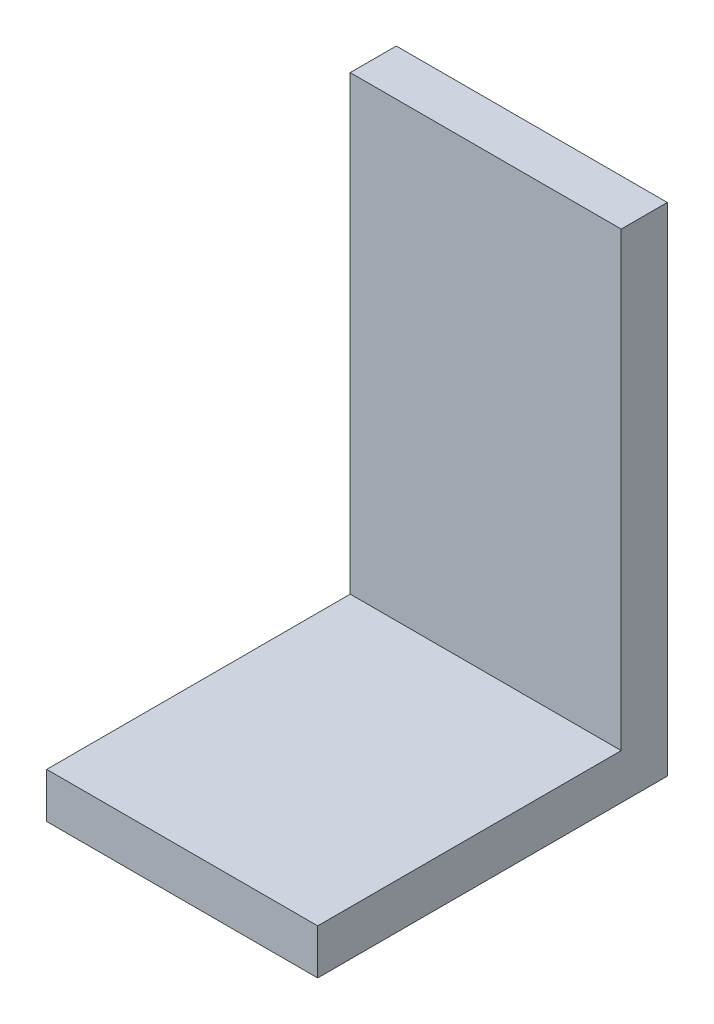
ISO-10303-21;
HEADER;
FILE_DESCRIPTION(('STEP AP214'),'2;1');
FILE_NAME('part.step','',(''),(''),'','','');
FILE_SCHEMA(('AUTOMOTIVE_DESIGN { 1 0 10303 214 1 1 1 1 }'));
ENDSEC;
DATA;
#1=APPLICATION_CONTEXT('core data for automotive mechanical design processes');
#2=APPLICATION_PROTOCOL_DEFINITION('international standard','automotive_design',2000,#1);
#3=PRODUCT_CONTEXT('',#1,'mechanical');
#4=PRODUCT('Part','Part','',(#3));
#5=PRODUCT_RELATED_PRODUCT_CATEGORY('part','',(#4));
#6=PRODUCT_DEFINITION_FORMATION('','',#4);
#7=PRODUCT_DEFINITION_CONTEXT('part definition',#1,'design');
#8=PRODUCT_DEFINITION('design','',#6,#7);
#9=PRODUCT_DEFINITION_SHAPE('','',#8);
#10=(LENGTH_UNIT() NAMED_UNIT(*) SI_UNIT(.MILLI.,.METRE.));
#11=(NAMED_UNIT(*) PLANE_ANGLE_UNIT() SI_UNIT($,.RADIAN.));
#12=(NAMED_UNIT(*) SI_UNIT($,.STERADIAN.) SOLID_ANGLE_UNIT());
#13=UNCERTAINTY_MEASURE_WITH_UNIT(LENGTH_MEASURE(1.E-05),#10,'distance_accuracy_value','');
#14=(GEOMETRIC_REPRESENTATION_CONTEXT(3) GLOBAL_UNCERTAINTY_ASSIGNED_CONTEXT((#13)) GLOBAL_UNIT_ASSIGNED_CONTEXT((#10,
#11,#12)) REPRESENTATION_CONTEXT('',''));
#15=CARTESIAN_POINT('',(0.,0.,0.));
#16=DIRECTION('',(0.,0.,1.));
#17=DIRECTION('',(1.,0.,0.));
#18=AXIS2_PLACEMENT_3D('',#15,#16,#17);
#19=CARTESIAN_POINT('',(1.4,-4.55,0.));
#20=DIRECTION('',(1.,0.,0.));
#21=DIRECTION('',(0.,0.,1.));
#22=AXIS2_PLACEMENT_3D('',#19,#20,#21);
#23=PLANE('',#22);
#24=DIRECTION('',(0.,-1.,0.));
#25=VECTOR('',#24,1.);
#26=CARTESIAN_POINT('',(1.4,-4.,0.));
#27=LINE('',#26,#25);
#28=CARTESIAN_POINT('',(1.4,-4.,0.));
#29=VERTEX_POINT('',#28);
#30=CARTESIAN_POINT('',(1.4,-4.55,0.));
#31=VERTEX_POINT('',#30);
#32=EDGE_CURVE('E11',#29,#31,#27,.T.);
#33=ORIENTED_EDGE('',*,*,#32,.F.);
#34=DIRECTION('',(0.,0.,-1.));
#35=VECTOR('',#34,1.);
#36=CARTESIAN_POINT('',(1.4,-4.,0.051));
#37=LINE('',#36,#35);
#38=CARTESIAN_POINT('',(1.4,-4.,0.051));
#39=VERTEX_POINT('',#38);
#40=EDGE_CURVE('E24',#39,#29,#37,.T.);
#41=ORIENTED_EDGE('',*,*,#40,.F.);
#42=DIRECTION('',(0.,1.,0.));
#43=VECTOR('',#42,1.);
#44=CARTESIAN_POINT('',(1.4,-4.5,0.051));
#45=LINE('',#44,#43);
#46=CARTESIAN_POINT('',(1.4,-4.5,0.051));
#47=VERTEX_POINT('',#46);
#48=EDGE_CURVE('E87',#47,#39,#45,.T.);
#49=ORIENTED_EDGE('',*,*,#48,.F.);
#50=DIRECTION('',(0.,0.,-1.));
#51=VECTOR('',#50,1.);
#52=CARTESIAN_POINT('',(1.4,-4.5,0.387));
#53=LINE('',#52,#51);
#54=CARTESIAN_POINT('',(1.4,-4.5,0.387));
#55=VERTEX_POINT('',#54);
#56=EDGE_CURVE('E114',#55,#47,#53,.T.);
#57=ORIENTED_EDGE('',*,*,#56,.F.);
#58=DIRECTION('',(0.,1.,0.));
#59=VECTOR('',#58,1.);
#60=CARTESIAN_POINT('',(1.4,-4.55,0.387));
#61=LINE('',#60,#59);
#62=CARTESIAN_POINT('',(1.4,-4.55,0.387));
#63=VERTEX_POINT('',#62);
#64=EDGE_CURVE('E111',#63,#55,#61,.T.);
#65=ORIENTED_EDGE('',*,*,#64,.F.);
#66=DIRECTION('',(0.,0.,1.));
#67=VECTOR('',#66,1.);
#68=CARTESIAN_POINT('',(1.4,-4.55,0.));
#69=LINE('',#68,#67);
#70=EDGE_CURVE('E108',#31,#63,#69,.T.);
#71=ORIENTED_EDGE('',*,*,#70,.F.);
#72=EDGE_LOOP('',(#33,#41,#49,#57,#65,#71));
#73=FACE_BOUND('',#72,.T.);
#74=ADVANCED_FACE('F17',(#73),#23,.T.);
#75=CARTESIAN_POINT('',(1.1,-4.,0.));
#76=DIRECTION('',(-1.,0.,0.));
#77=DIRECTION('',(0.,0.,1.));
#78=AXIS2_PLACEMENT_3D('',#75,#76,#77);
#79=PLANE('',#78);
#80=DIRECTION('',(0.,1.,0.));
#81=VECTOR('',#80,1.);
#82=CARTESIAN_POINT('',(1.1,-4.55,0.));
#83=LINE('',#82,#81);
#84=CARTESIAN_POINT('',(1.1,-4.55,0.));
#85=VERTEX_POINT('',#84);
#86=CARTESIAN_POINT('',(1.1,-4.,0.));
#87=VERTEX_POINT('',#86);
#88=EDGE_CURVE('E106',#85,#87,#83,.T.);
#89=ORIENTED_EDGE('',*,*,#88,.F.);
#90=DIRECTION('',(0.,0.,-1.));
#91=VECTOR('',#90,1.);
#92=CARTESIAN_POINT('',(1.1,-4.55,0.387));
#93=LINE('',#92,#91);
#94=CARTESIAN_POINT('',(1.1,-4.55,0.387));
#95=VERTEX_POINT('',#94);
#96=EDGE_CURVE('E103',#95,#85,#93,.T.);
#97=ORIENTED_EDGE('',*,*,#96,.F.);
#98=DIRECTION('',(0.,-1.,0.));
#99=VECTOR('',#98,1.);
#100=CARTESIAN_POINT('',(1.1,-4.5,0.387));
#101=LINE('',#100,#99);
#102=CARTESIAN_POINT('',(1.1,-4.5,0.387));
#103=VERTEX_POINT('',#102);
#104=EDGE_CURVE('E100',#103,#95,#101,.T.);
#105=ORIENTED_EDGE('',*,*,#104,.F.);
#106=DIRECTION('',(0.,0.,1.));
#107=VECTOR('',#106,1.);
#108=CARTESIAN_POINT('',(1.1,-4.5,0.051));
#109=LINE('',#108,#107);
#110=CARTESIAN_POINT('',(1.1,-4.5,0.051));
#111=VERTEX_POINT('',#110);
#112=EDGE_CURVE('E72',#111,#103,#109,.T.);
#113=ORIENTED_EDGE('',*,*,#112,.F.);
#114=DIRECTION('',(0.,-1.,0.));
#115=VECTOR('',#114,1.);
#116=CARTESIAN_POINT('',(1.1,-4.,0.051));
#117=LINE('',#116,#115);
#118=CARTESIAN_POINT('',(1.1,-4.,0.051));
#119=VERTEX_POINT('',#118);
#120=EDGE_CURVE('E66',#119,#111,#117,.T.);
#121=ORIENTED_EDGE('',*,*,#120,.F.);
#122=DIRECTION('',(0.,0.,1.));
#123=VECTOR('',#122,1.);
#124=CARTESIAN_POINT('',(1.1,-4.,0.));
#125=LINE('',#124,#123);
#126=EDGE_CURVE('E69',#87,#119,#125,.T.);
#127=ORIENTED_EDGE('',*,*,#126,.F.);
#128=EDGE_LOOP('',(#89,#97,#105,#113,#121,#127));
#129=FACE_BOUND('',#128,.T.);
#130=ADVANCED_FACE('F68',(#129),#79,.T.);
#131=CARTESIAN_POINT('',(1.4,-4.55,0.387));
#132=DIRECTION('',(0.,0.,1.));
#133=DIRECTION('',(0.,1.,0.));
#134=AXIS2_PLACEMENT_3D('',#131,#132,#133);
#135=PLANE('',#134);
#136=ORIENTED_EDGE('',*,*,#64,.T.);
#137=DIRECTION('',(1.,0.,0.));
#138=VECTOR('',#137,1.);
#139=CARTESIAN_POINT('',(1.1,-4.5,0.387));
#140=LINE('',#139,#138);
#141=EDGE_CURVE('E83',#103,#55,#140,.T.);
#142=ORIENTED_EDGE('',*,*,#141,.F.);
#143=ORIENTED_EDGE('',*,*,#104,.T.);
#144=DIRECTION('',(-1.,0.,0.));
#145=VECTOR('',#144,1.);
#146=CARTESIAN_POINT('',(1.4,-4.55,0.387));
#147=LINE('',#146,#145);
#148=EDGE_CURVE('E88',#63,#95,#147,.T.);
#149=ORIENTED_EDGE('',*,*,#148,.F.);
#150=EDGE_LOOP('',(#136,#142,#143,#149));
#151=FACE_BOUND('',#150,.T.);
#152=ADVANCED_FACE('F125',(#151),#135,.T.);
#153=CARTESIAN_POINT('',(1.4,-4.5,0.051));
#154=DIRECTION('',(0.,0.,1.));
#155=DIRECTION('',(0.,1.,0.));
#156=AXIS2_PLACEMENT_3D('',#153,#154,#155);
#157=PLANE('',#156);
#158=ORIENTED_EDGE('',*,*,#48,.T.);
#159=DIRECTION('',(1.,0.,0.));
#160=VECTOR('',#159,1.);
#161=CARTESIAN_POINT('',(1.1,-4.,0.051));
#162=LINE('',#161,#160);
#163=EDGE_CURVE('E81',#119,#39,#162,.T.);
#164=ORIENTED_EDGE('',*,*,#163,.F.);
#165=ORIENTED_EDGE('',*,*,#120,.T.);
#166=DIRECTION('',(-1.,0.,0.));
#167=VECTOR('',#166,1.);
#168=CARTESIAN_POINT('',(1.4,-4.5,0.051));
#169=LINE('',#168,#167);
#170=EDGE_CURVE('E89',#47,#111,#169,.T.);
#171=ORIENTED_EDGE('',*,*,#170,.F.);
#172=EDGE_LOOP('',(#158,#164,#165,#171));
#173=FACE_BOUND('',#172,.T.);
#174=ADVANCED_FACE('F86',(#173),#157,.T.);
#175=CARTESIAN_POINT('',(1.1,-4.55,0.));
#176=DIRECTION('',(0.,-1.,0.));
#177=DIRECTION('',(0.,0.,1.));
#178=AXIS2_PLACEMENT_3D('',#175,#176,#177);
#179=PLANE('',#178);
#180=DIRECTION('',(-1.,0.,0.));
#181=VECTOR('',#180,1.);
#182=CARTESIAN_POINT('',(1.4,-4.55,0.));
#183=LINE('',#182,#181);
#184=EDGE_CURVE('E93',#31,#85,#183,.T.);
#185=ORIENTED_EDGE('',*,*,#184,.F.);
#186=ORIENTED_EDGE('',*,*,#70,.T.);
#187=ORIENTED_EDGE('',*,*,#148,.T.);
#188=ORIENTED_EDGE('',*,*,#96,.T.);
#189=EDGE_LOOP('',(#185,#186,#187,#188));
#190=FACE_BOUND('',#189,.T.);
#191=ADVANCED_FACE('F121',(#190),#179,.T.);
#192=CARTESIAN_POINT('',(1.4,-4.,0.));
#193=DIRECTION('',(0.,1.,0.));
#194=DIRECTION('',(0.,0.,1.));
#195=AXIS2_PLACEMENT_3D('',#192,#193,#194);
#196=PLANE('',#195);
#197=DIRECTION('',(1.,0.,0.));
#198=VECTOR('',#197,1.);
#199=CARTESIAN_POINT('',(1.1,-4.,0.));
#200=LINE('',#199,#198);
#201=EDGE_CURVE('E82',#87,#29,#200,.T.);
#202=ORIENTED_EDGE('',*,*,#201,.F.);
#203=ORIENTED_EDGE('',*,*,#126,.T.);
#204=ORIENTED_EDGE('',*,*,#163,.T.);
#205=ORIENTED_EDGE('',*,*,#40,.T.);
#206=EDGE_LOOP('',(#202,#203,#204,#205));
#207=FACE_BOUND('',#206,.T.);
#208=ADVANCED_FACE('F80',(#207),#196,.T.);
#209=CARTESIAN_POINT('',(1.4,-4.5,0.051));
#210=DIRECTION('',(0.,1.,0.));
#211=DIRECTION('',(0.,0.,1.));
#212=AXIS2_PLACEMENT_3D('',#209,#210,#211);
#213=PLANE('',#212);
#214=ORIENTED_EDGE('',*,*,#170,.T.);
#215=ORIENTED_EDGE('',*,*,#112,.T.);
#216=ORIENTED_EDGE('',*,*,#141,.T.);
#217=ORIENTED_EDGE('',*,*,#56,.T.);
#218=EDGE_LOOP('',(#214,#215,#216,#217));
#219=FACE_BOUND('',#218,.T.);
#220=ADVANCED_FACE('F127',(#219),#213,.T.);
#221=CARTESIAN_POINT('',(1.1,-4.55,0.));
#222=DIRECTION('',(0.,0.,-1.));
#223=DIRECTION('',(0.,1.,0.));
#224=AXIS2_PLACEMENT_3D('',#221,#222,#223);
#225=PLANE('',#224);
#226=ORIENTED_EDGE('',*,*,#88,.T.);
#227=ORIENTED_EDGE('',*,*,#201,.T.);
#228=ORIENTED_EDGE('',*,*,#32,.T.);
#229=ORIENTED_EDGE('',*,*,#184,.T.);
#230=EDGE_LOOP('',(#226,#227,#228,#229));
#231=FACE_BOUND('',#230,.T.);
#232=ADVANCED_FACE('F117',(#231),#225,.T.);
#233=CLOSED_SHELL('',(#74,#130,#152,#174,#191,#208,#220,#232));
#234=MANIFOLD_SOLID_BREP('B1',#233);
#235=ADVANCED_BREP_SHAPE_REPRESENTATION('',(#18,#234),#14);
#236=SHAPE_DEFINITION_REPRESENTATION(#9,#235);
ENDSEC;
END-ISO-10303-21;
